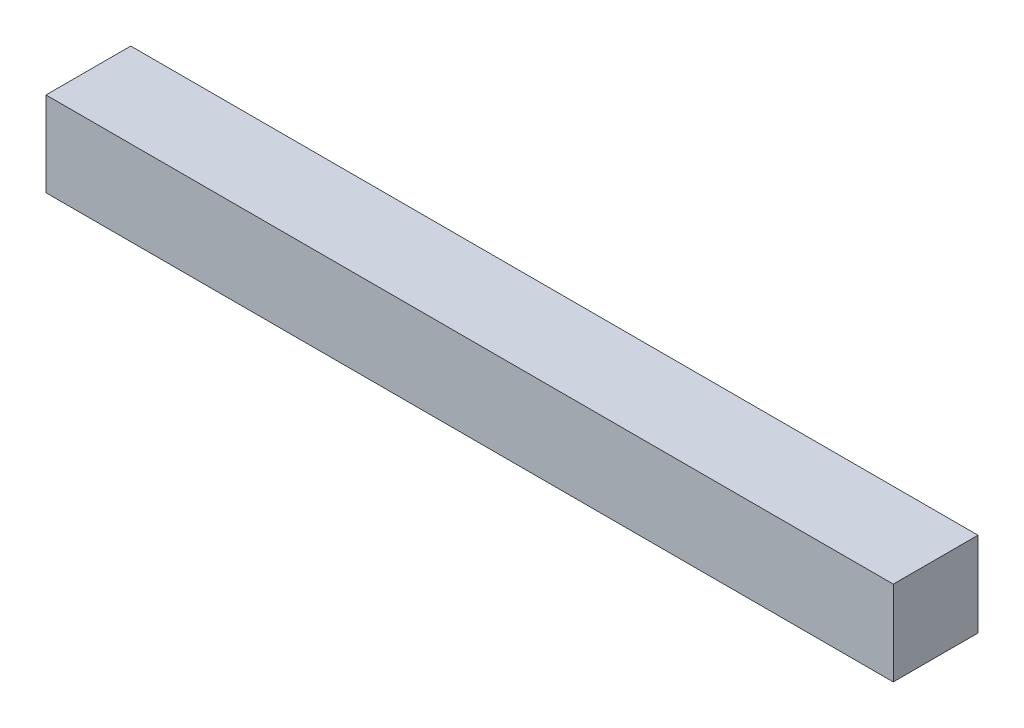
ISO-10303-21;
HEADER;
FILE_DESCRIPTION(('STEP AP214'),'2;1');
FILE_NAME('part.step','',(''),(''),'','','');
FILE_SCHEMA(('AUTOMOTIVE_DESIGN { 1 0 10303 214 1 1 1 1 }'));
ENDSEC;
DATA;
#1=APPLICATION_CONTEXT('core data for automotive mechanical design processes');
#2=APPLICATION_PROTOCOL_DEFINITION('international standard','automotive_design',2000,#1);
#3=PRODUCT_CONTEXT('',#1,'mechanical');
#4=PRODUCT('Part','Part','',(#3));
#5=PRODUCT_RELATED_PRODUCT_CATEGORY('part','',(#4));
#6=PRODUCT_DEFINITION_FORMATION('','',#4);
#7=PRODUCT_DEFINITION_CONTEXT('part definition',#1,'design');
#8=PRODUCT_DEFINITION('design','',#6,#7);
#9=PRODUCT_DEFINITION_SHAPE('','',#8);
#10=(LENGTH_UNIT() NAMED_UNIT(*) SI_UNIT(.MILLI.,.METRE.));
#11=(NAMED_UNIT(*) PLANE_ANGLE_UNIT() SI_UNIT($,.RADIAN.));
#12=(NAMED_UNIT(*) SI_UNIT($,.STERADIAN.) SOLID_ANGLE_UNIT());
#13=UNCERTAINTY_MEASURE_WITH_UNIT(LENGTH_MEASURE(1.E-05),#10,'distance_accuracy_value','');
#14=(GEOMETRIC_REPRESENTATION_CONTEXT(3) GLOBAL_UNCERTAINTY_ASSIGNED_CONTEXT((#13)) GLOBAL_UNIT_ASSIGNED_CONTEXT((#10,
#11,#12)) REPRESENTATION_CONTEXT('',''));
#15=CARTESIAN_POINT('',(0.,0.,0.));
#16=DIRECTION('',(0.,0.,1.));
#17=DIRECTION('',(1.,0.,0.));
#18=AXIS2_PLACEMENT_3D('',#15,#16,#17);
#19=CARTESIAN_POINT('',(150.,15.,-15.));
#20=DIRECTION('',(0.,0.,1.));
#21=DIRECTION('',(0.,-1.,0.));
#22=AXIS2_PLACEMENT_3D('',#19,#20,#21);
#23=PLANE('',#22);
#24=DIRECTION('',(0.,1.,0.));
#25=VECTOR('',#24,1.);
#26=CARTESIAN_POINT('',(-150.,15.,-15.));
#27=LINE('',#26,#25);
#28=CARTESIAN_POINT('',(-150.,-15.,-15.));
#29=VERTEX_POINT('',#28);
#30=CARTESIAN_POINT('',(-150.,15.,-15.));
#31=VERTEX_POINT('',#30);
#32=EDGE_CURVE('E101',#29,#31,#27,.T.);
#33=ORIENTED_EDGE('',*,*,#32,.T.);
#34=DIRECTION('',(-1.,0.,0.));
#35=VECTOR('',#34,1.);
#36=CARTESIAN_POINT('',(150.,15.,-15.));
#37=LINE('',#36,#35);
#38=CARTESIAN_POINT('',(150.,15.,-15.));
#39=VERTEX_POINT('',#38);
#40=EDGE_CURVE('E11',#39,#31,#37,.T.);
#41=ORIENTED_EDGE('',*,*,#40,.F.);
#42=DIRECTION('',(0.,1.,0.));
#43=VECTOR('',#42,1.);
#44=CARTESIAN_POINT('',(150.,15.,-15.));
#45=LINE('',#44,#43);
#46=CARTESIAN_POINT('',(150.,-15.,-15.));
#47=VERTEX_POINT('',#46);
#48=EDGE_CURVE('E88',#47,#39,#45,.T.);
#49=ORIENTED_EDGE('',*,*,#48,.F.);
#50=DIRECTION('',(-1.,0.,0.));
#51=VECTOR('',#50,1.);
#52=CARTESIAN_POINT('',(150.,-15.,-15.));
#53=LINE('',#52,#51);
#54=EDGE_CURVE('E97',#47,#29,#53,.T.);
#55=ORIENTED_EDGE('',*,*,#54,.T.);
#56=EDGE_LOOP('',(#33,#41,#49,#55));
#57=FACE_BOUND('',#56,.T.);
#58=ADVANCED_FACE('F37',(#57),#23,.F.);
#59=CARTESIAN_POINT('',(150.,15.,15.));
#60=DIRECTION('',(0.,-1.,0.));
#61=DIRECTION('',(0.,0.,-1.));
#62=AXIS2_PLACEMENT_3D('',#59,#60,#61);
#63=PLANE('',#62);
#64=DIRECTION('',(0.,0.,1.));
#65=VECTOR('',#64,1.);
#66=CARTESIAN_POINT('',(-150.,15.,15.));
#67=LINE('',#66,#65);
#68=CARTESIAN_POINT('',(-150.,15.,15.));
#69=VERTEX_POINT('',#68);
#70=EDGE_CURVE('E92',#31,#69,#67,.T.);
#71=ORIENTED_EDGE('',*,*,#70,.T.);
#72=DIRECTION('',(-1.,0.,0.));
#73=VECTOR('',#72,1.);
#74=CARTESIAN_POINT('',(150.,15.,15.));
#75=LINE('',#74,#73);
#76=CARTESIAN_POINT('',(150.,15.,15.));
#77=VERTEX_POINT('',#76);
#78=EDGE_CURVE('E45',#77,#69,#75,.T.);
#79=ORIENTED_EDGE('',*,*,#78,.F.);
#80=DIRECTION('',(0.,0.,1.));
#81=VECTOR('',#80,1.);
#82=CARTESIAN_POINT('',(150.,15.,15.));
#83=LINE('',#82,#81);
#84=EDGE_CURVE('E83',#39,#77,#83,.T.);
#85=ORIENTED_EDGE('',*,*,#84,.F.);
#86=ORIENTED_EDGE('',*,*,#40,.T.);
#87=EDGE_LOOP('',(#71,#79,#85,#86));
#88=FACE_BOUND('',#87,.T.);
#89=ADVANCED_FACE('F91',(#88),#63,.F.);
#90=CARTESIAN_POINT('',(150.,15.,15.));
#91=DIRECTION('',(0.,0.,-1.));
#92=DIRECTION('',(0.,1.,0.));
#93=AXIS2_PLACEMENT_3D('',#90,#91,#92);
#94=PLANE('',#93);
#95=DIRECTION('',(0.,-1.,0.));
#96=VECTOR('',#95,1.);
#97=CARTESIAN_POINT('',(-150.,15.,15.));
#98=LINE('',#97,#96);
#99=CARTESIAN_POINT('',(-150.,-15.,15.));
#100=VERTEX_POINT('',#99);
#101=EDGE_CURVE('E70',#69,#100,#98,.T.);
#102=ORIENTED_EDGE('',*,*,#101,.T.);
#103=DIRECTION('',(-1.,0.,0.));
#104=VECTOR('',#103,1.);
#105=CARTESIAN_POINT('',(150.,-15.,15.));
#106=LINE('',#105,#104);
#107=CARTESIAN_POINT('',(150.,-15.,15.));
#108=VERTEX_POINT('',#107);
#109=EDGE_CURVE('E94',#108,#100,#106,.T.);
#110=ORIENTED_EDGE('',*,*,#109,.F.);
#111=DIRECTION('',(0.,-1.,0.));
#112=VECTOR('',#111,1.);
#113=CARTESIAN_POINT('',(150.,15.,15.));
#114=LINE('',#113,#112);
#115=EDGE_CURVE('E86',#77,#108,#114,.T.);
#116=ORIENTED_EDGE('',*,*,#115,.F.);
#117=ORIENTED_EDGE('',*,*,#78,.T.);
#118=EDGE_LOOP('',(#102,#110,#116,#117));
#119=FACE_BOUND('',#118,.T.);
#120=ADVANCED_FACE('F95',(#119),#94,.F.);
#121=CARTESIAN_POINT('',(150.,-15.,15.));
#122=DIRECTION('',(0.,1.,0.));
#123=DIRECTION('',(0.,0.,1.));
#124=AXIS2_PLACEMENT_3D('',#121,#122,#123);
#125=PLANE('',#124);
#126=DIRECTION('',(0.,0.,-1.));
#127=VECTOR('',#126,1.);
#128=CARTESIAN_POINT('',(-150.,-15.,15.));
#129=LINE('',#128,#127);
#130=EDGE_CURVE('E76',#100,#29,#129,.T.);
#131=ORIENTED_EDGE('',*,*,#130,.T.);
#132=ORIENTED_EDGE('',*,*,#54,.F.);
#133=DIRECTION('',(0.,0.,-1.));
#134=VECTOR('',#133,1.);
#135=CARTESIAN_POINT('',(150.,-15.,15.));
#136=LINE('',#135,#134);
#137=EDGE_CURVE('E53',#108,#47,#136,.T.);
#138=ORIENTED_EDGE('',*,*,#137,.F.);
#139=ORIENTED_EDGE('',*,*,#109,.T.);
#140=EDGE_LOOP('',(#131,#132,#138,#139));
#141=FACE_BOUND('',#140,.T.);
#142=ADVANCED_FACE('F108',(#141),#125,.F.);
#143=CARTESIAN_POINT('',(150.,0.,0.));
#144=DIRECTION('',(1.,0.,0.));
#145=DIRECTION('',(0.,0.,-1.));
#146=AXIS2_PLACEMENT_3D('',#143,#144,#145);
#147=PLANE('',#146);
#148=ORIENTED_EDGE('',*,*,#48,.T.);
#149=ORIENTED_EDGE('',*,*,#84,.T.);
#150=ORIENTED_EDGE('',*,*,#115,.T.);
#151=ORIENTED_EDGE('',*,*,#137,.T.);
#152=EDGE_LOOP('',(#148,#149,#150,#151));
#153=FACE_BOUND('',#152,.T.);
#154=ADVANCED_FACE('F84',(#153),#147,.T.);
#155=CARTESIAN_POINT('',(-150.,0.,0.));
#156=DIRECTION('',(1.,0.,0.));
#157=DIRECTION('',(0.,0.,-1.));
#158=AXIS2_PLACEMENT_3D('',#155,#156,#157);
#159=PLANE('',#158);
#160=ORIENTED_EDGE('',*,*,#32,.F.);
#161=ORIENTED_EDGE('',*,*,#130,.F.);
#162=ORIENTED_EDGE('',*,*,#101,.F.);
#163=ORIENTED_EDGE('',*,*,#70,.F.);
#164=EDGE_LOOP('',(#160,#161,#162,#163));
#165=FACE_BOUND('',#164,.T.);
#166=ADVANCED_FACE('F111',(#165),#159,.F.);
#167=CLOSED_SHELL('',(#58,#89,#120,#142,#154,#166));
#168=MANIFOLD_SOLID_BREP('B2',#167);
#169=ADVANCED_BREP_SHAPE_REPRESENTATION('',(#18,#168),#14);
#170=SHAPE_DEFINITION_REPRESENTATION(#9,#169);
ENDSEC;
END-ISO-10303-21;
